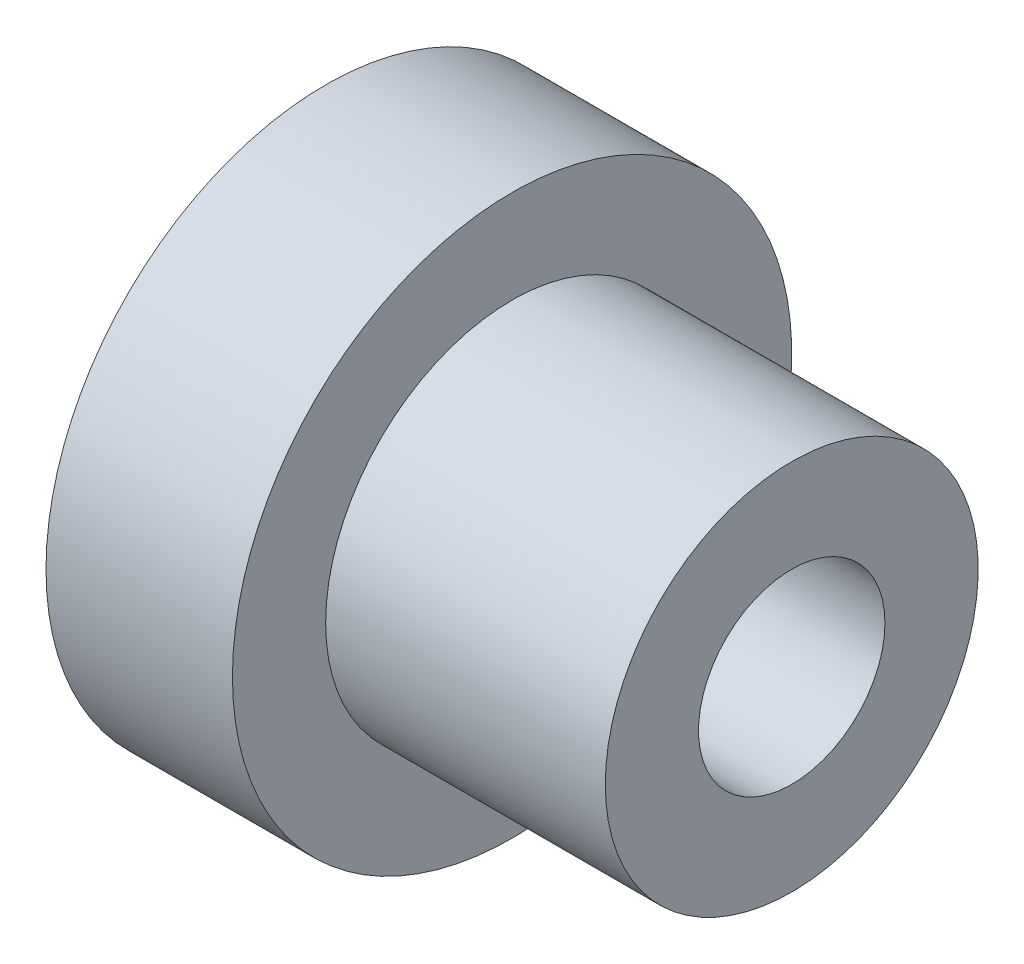
ISO-10303-21;
HEADER;
FILE_DESCRIPTION(('STEP AP214'),'2;1');
FILE_NAME('part.step','',(''),(''),'','','');
FILE_SCHEMA(('AUTOMOTIVE_DESIGN { 1 0 10303 214 1 1 1 1 }'));
ENDSEC;
DATA;
#1=APPLICATION_CONTEXT('core data for automotive mechanical design processes');
#2=APPLICATION_PROTOCOL_DEFINITION('international standard','automotive_design',2000,#1);
#3=PRODUCT_CONTEXT('',#1,'mechanical');
#4=PRODUCT('Part','Part','',(#3));
#5=PRODUCT_RELATED_PRODUCT_CATEGORY('part','',(#4));
#6=PRODUCT_DEFINITION_FORMATION('','',#4);
#7=PRODUCT_DEFINITION_CONTEXT('part definition',#1,'design');
#8=PRODUCT_DEFINITION('design','',#6,#7);
#9=PRODUCT_DEFINITION_SHAPE('','',#8);
#10=(LENGTH_UNIT() NAMED_UNIT(*) SI_UNIT(.MILLI.,.METRE.));
#11=(NAMED_UNIT(*) PLANE_ANGLE_UNIT() SI_UNIT($,.RADIAN.));
#12=(NAMED_UNIT(*) SI_UNIT($,.STERADIAN.) SOLID_ANGLE_UNIT());
#13=UNCERTAINTY_MEASURE_WITH_UNIT(LENGTH_MEASURE(1.E-05),#10,'distance_accuracy_value','');
#14=(GEOMETRIC_REPRESENTATION_CONTEXT(3) GLOBAL_UNCERTAINTY_ASSIGNED_CONTEXT((#13)) GLOBAL_UNIT_ASSIGNED_CONTEXT((#10,
#11,#12)) REPRESENTATION_CONTEXT('',''));
#15=CARTESIAN_POINT('',(0.,0.,0.));
#16=DIRECTION('',(0.,0.,1.));
#17=DIRECTION('',(1.,0.,0.));
#18=AXIS2_PLACEMENT_3D('',#15,#16,#17);
#19=CARTESIAN_POINT('',(0.,0.,0.));
#20=DIRECTION('',(1.,0.,0.));
#21=DIRECTION('',(0.,0.,-1.));
#22=AXIS2_PLACEMENT_3D('',#19,#20,#21);
#23=PLANE('',#22);
#24=CARTESIAN_POINT('',(0.,0.,0.));
#25=DIRECTION('',(1.,0.,0.));
#26=DIRECTION('',(0.,0.,-1.));
#27=AXIS2_PLACEMENT_3D('',#24,#25,#26);
#28=CIRCLE('',#27,1.5);
#29=CARTESIAN_POINT('',(0.,0.,-1.5));
#30=VERTEX_POINT('',#29);
#31=EDGE_CURVE('E50',#30,#30,#28,.T.);
#32=ORIENTED_EDGE('',*,*,#31,.T.);
#33=EDGE_LOOP('',(#32));
#34=FACE_BOUND('',#33,.T.);
#35=CARTESIAN_POINT('',(0.,0.,0.));
#36=DIRECTION('',(-1.,0.,0.));
#37=DIRECTION('',(0.,0.,1.));
#38=AXIS2_PLACEMENT_3D('',#35,#36,#37);
#39=CIRCLE('',#38,4.5);
#40=CARTESIAN_POINT('',(0.,0.,4.5));
#41=VERTEX_POINT('',#40);
#42=EDGE_CURVE('E10',#41,#41,#39,.T.);
#43=ORIENTED_EDGE('',*,*,#42,.T.);
#44=EDGE_LOOP('',(#43));
#45=FACE_BOUND('',#44,.T.);
#46=ADVANCED_FACE('F31',(#34,#45),#23,.F.);
#47=CARTESIAN_POINT('',(-5.51657994698473,0.,0.));
#48=DIRECTION('',(-1.,0.,0.));
#49=DIRECTION('',(0.,0.,1.));
#50=AXIS2_PLACEMENT_3D('',#47,#48,#49);
#51=CYLINDRICAL_SURFACE('',#50,4.5);
#52=ORIENTED_EDGE('',*,*,#42,.F.);
#53=EDGE_LOOP('',(#52));
#54=FACE_BOUND('',#53,.T.);
#55=CARTESIAN_POINT('',(3.,0.,0.));
#56=DIRECTION('',(-1.,0.,0.));
#57=DIRECTION('',(0.,0.,1.));
#58=AXIS2_PLACEMENT_3D('',#55,#56,#57);
#59=CIRCLE('',#58,4.5);
#60=CARTESIAN_POINT('',(3.,0.,4.5));
#61=VERTEX_POINT('',#60);
#62=EDGE_CURVE('E37',#61,#61,#59,.T.);
#63=ORIENTED_EDGE('',*,*,#62,.T.);
#64=EDGE_LOOP('',(#63));
#65=FACE_BOUND('',#64,.T.);
#66=ADVANCED_FACE('F78',(#54,#65),#51,.T.);
#67=CARTESIAN_POINT('',(3.,4.5,0.));
#68=DIRECTION('',(-1.,0.,0.));
#69=DIRECTION('',(0.,0.,1.));
#70=AXIS2_PLACEMENT_3D('',#67,#68,#69);
#71=PLANE('',#70);
#72=ORIENTED_EDGE('',*,*,#62,.F.);
#73=EDGE_LOOP('',(#72));
#74=FACE_BOUND('',#73,.T.);
#75=CARTESIAN_POINT('',(3.,0.,0.));
#76=DIRECTION('',(-1.,0.,0.));
#77=DIRECTION('',(0.,0.,1.));
#78=AXIS2_PLACEMENT_3D('',#75,#76,#77);
#79=CIRCLE('',#78,3.);
#80=CARTESIAN_POINT('',(3.,0.,3.));
#81=VERTEX_POINT('',#80);
#82=EDGE_CURVE('E41',#81,#81,#79,.T.);
#83=ORIENTED_EDGE('',*,*,#82,.T.);
#84=EDGE_LOOP('',(#83));
#85=FACE_BOUND('',#84,.T.);
#86=ADVANCED_FACE('F72',(#74,#85),#71,.F.);
#87=CARTESIAN_POINT('',(-5.51657994698473,0.,0.));
#88=DIRECTION('',(-1.,0.,0.));
#89=DIRECTION('',(0.,0.,1.));
#90=AXIS2_PLACEMENT_3D('',#87,#88,#89);
#91=CYLINDRICAL_SURFACE('',#90,3.);
#92=ORIENTED_EDGE('',*,*,#82,.F.);
#93=EDGE_LOOP('',(#92));
#94=FACE_BOUND('',#93,.T.);
#95=CARTESIAN_POINT('',(7.5,0.,0.));
#96=DIRECTION('',(-1.,0.,0.));
#97=DIRECTION('',(0.,0.,1.));
#98=AXIS2_PLACEMENT_3D('',#95,#96,#97);
#99=CIRCLE('',#98,3.);
#100=CARTESIAN_POINT('',(7.5,0.,3.));
#101=VERTEX_POINT('',#100);
#102=EDGE_CURVE('E45',#101,#101,#99,.T.);
#103=ORIENTED_EDGE('',*,*,#102,.T.);
#104=EDGE_LOOP('',(#103));
#105=FACE_BOUND('',#104,.T.);
#106=ADVANCED_FACE('F67',(#94,#105),#91,.T.);
#107=CARTESIAN_POINT('',(7.5,3.,0.));
#108=DIRECTION('',(-1.,0.,0.));
#109=DIRECTION('',(0.,0.,1.));
#110=AXIS2_PLACEMENT_3D('',#107,#108,#109);
#111=PLANE('',#110);
#112=CARTESIAN_POINT('',(7.5,0.,0.));
#113=DIRECTION('',(1.,0.,0.));
#114=DIRECTION('',(0.,0.,-1.));
#115=AXIS2_PLACEMENT_3D('',#112,#113,#114);
#116=CIRCLE('',#115,1.5);
#117=CARTESIAN_POINT('',(7.5,0.,-1.5));
#118=VERTEX_POINT('',#117);
#119=EDGE_CURVE('E51',#118,#118,#116,.T.);
#120=ORIENTED_EDGE('',*,*,#119,.F.);
#121=EDGE_LOOP('',(#120));
#122=FACE_BOUND('',#121,.T.);
#123=ORIENTED_EDGE('',*,*,#102,.F.);
#124=EDGE_LOOP('',(#123));
#125=FACE_BOUND('',#124,.T.);
#126=ADVANCED_FACE('F61',(#122,#125),#111,.F.);
#127=CARTESIAN_POINT('',(0.,0.,0.));
#128=DIRECTION('',(1.,0.,0.));
#129=DIRECTION('',(0.,0.,-1.));
#130=AXIS2_PLACEMENT_3D('',#127,#128,#129);
#131=CYLINDRICAL_SURFACE('',#130,1.5);
#132=ORIENTED_EDGE('',*,*,#31,.F.);
#133=EDGE_LOOP('',(#132));
#134=FACE_BOUND('',#133,.T.);
#135=ORIENTED_EDGE('',*,*,#119,.T.);
#136=EDGE_LOOP('',(#135));
#137=FACE_BOUND('',#136,.T.);
#138=ADVANCED_FACE('F58',(#134,#137),#131,.F.);
#139=CLOSED_SHELL('',(#46,#66,#86,#106,#126,#138));
#140=MANIFOLD_SOLID_BREP('B2',#139);
#141=ADVANCED_BREP_SHAPE_REPRESENTATION('',(#18,#140),#14);
#142=SHAPE_DEFINITION_REPRESENTATION(#9,#141);
ENDSEC;
END-ISO-10303-21;
